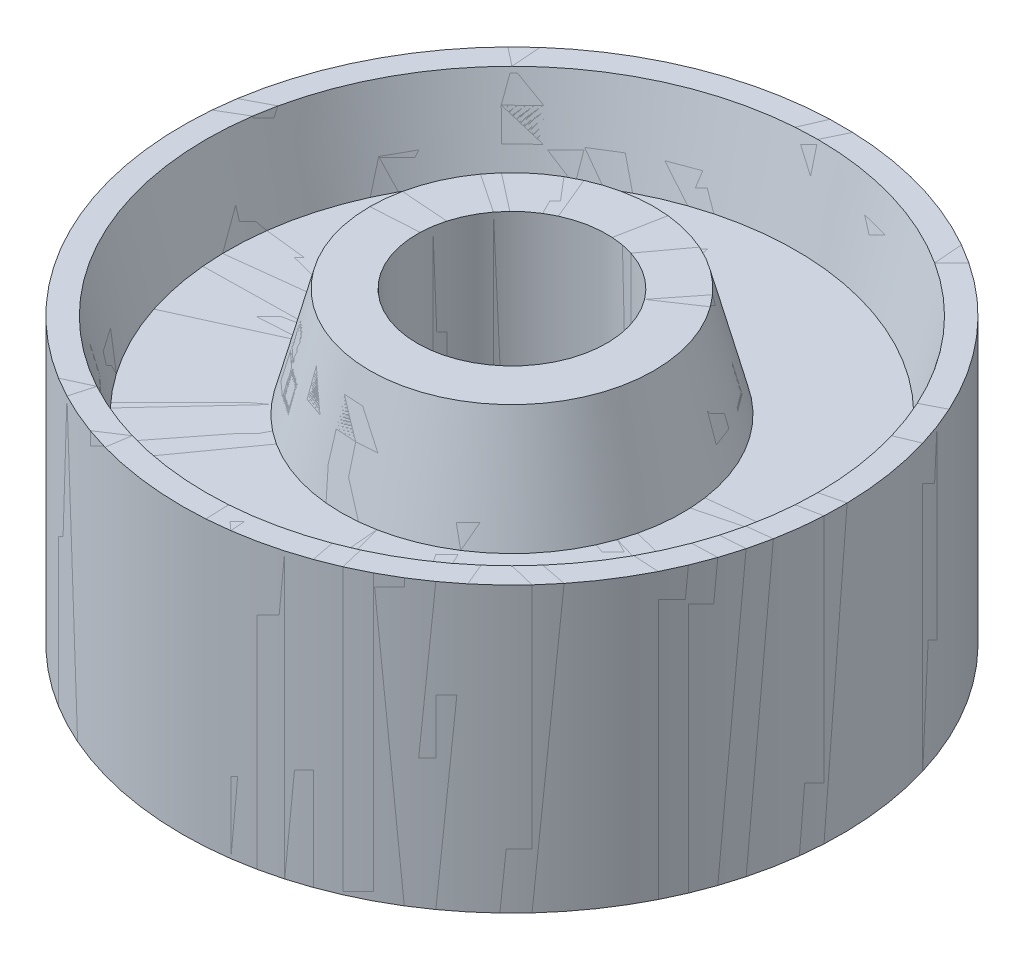
ISO-10303-21;
HEADER;
FILE_DESCRIPTION(('STEP AP214'),'2;1');
FILE_NAME('part.step','',(''),(''),'','','');
FILE_SCHEMA(('AUTOMOTIVE_DESIGN { 1 0 10303 214 1 1 1 1 }'));
ENDSEC;
DATA;
#1=APPLICATION_CONTEXT('core data for automotive mechanical design processes');
#2=APPLICATION_PROTOCOL_DEFINITION('international standard','automotive_design',2000,#1);
#3=PRODUCT_CONTEXT('',#1,'mechanical');
#4=PRODUCT('Part','Part','',(#3));
#5=PRODUCT_RELATED_PRODUCT_CATEGORY('part','',(#4));
#6=PRODUCT_DEFINITION_FORMATION('','',#4);
#7=PRODUCT_DEFINITION_CONTEXT('part definition',#1,'design');
#8=PRODUCT_DEFINITION('design','',#6,#7);
#9=PRODUCT_DEFINITION_SHAPE('','',#8);
#10=(LENGTH_UNIT() NAMED_UNIT(*) SI_UNIT(.MILLI.,.METRE.));
#11=(NAMED_UNIT(*) PLANE_ANGLE_UNIT() SI_UNIT($,.RADIAN.));
#12=(NAMED_UNIT(*) SI_UNIT($,.STERADIAN.) SOLID_ANGLE_UNIT());
#13=UNCERTAINTY_MEASURE_WITH_UNIT(LENGTH_MEASURE(1.E-05),#10,'distance_accuracy_value','');
#14=(GEOMETRIC_REPRESENTATION_CONTEXT(3) GLOBAL_UNCERTAINTY_ASSIGNED_CONTEXT((#13)) GLOBAL_UNIT_ASSIGNED_CONTEXT((#10,
#11,#12)) REPRESENTATION_CONTEXT('',''));
#15=CARTESIAN_POINT('',(0.,0.,0.));
#16=DIRECTION('',(0.,0.,1.));
#17=DIRECTION('',(1.,0.,0.));
#18=AXIS2_PLACEMENT_3D('',#15,#16,#17);
#19=CARTESIAN_POINT('',(41.021,17.7742163580739,0.));
#20=DIRECTION('',(0.,-1.,0.));
#21=DIRECTION('',(0.,0.,-1.));
#22=AXIS2_PLACEMENT_3D('',#19,#20,#21);
#23=PLANE('',#22);
#24=CARTESIAN_POINT('',(0.,17.7742163580739,0.));
#25=DIRECTION('',(0.,1.,0.));
#26=DIRECTION('',(0.,0.,1.));
#27=AXIS2_PLACEMENT_3D('',#24,#25,#26);
#28=CIRCLE('',#27,41.021);
#29=CARTESIAN_POINT('',(0.,17.7742163580739,41.021));
#30=VERTEX_POINT('',#29);
#31=EDGE_CURVE('E80',#30,#30,#28,.T.);
#32=ORIENTED_EDGE('',*,*,#31,.F.);
#33=EDGE_LOOP('',(#32));
#34=FACE_BOUND('',#33,.T.);
#35=CARTESIAN_POINT('',(0.,17.7742163580739,0.));
#36=DIRECTION('',(0.,1.,0.));
#37=DIRECTION('',(0.,0.,1.));
#38=AXIS2_PLACEMENT_3D('',#35,#36,#37);
#39=CIRCLE('',#38,44.196);
#40=CARTESIAN_POINT('',(0.,17.7742163580739,44.196));
#41=VERTEX_POINT('',#40);
#42=EDGE_CURVE('E11',#41,#41,#39,.T.);
#43=ORIENTED_EDGE('',*,*,#42,.T.);
#44=EDGE_LOOP('',(#43));
#45=FACE_BOUND('',#44,.T.);
#46=ADVANCED_FACE('F40',(#34,#45),#23,.F.);
#47=CARTESIAN_POINT('',(0.,42.7314059871606,0.));
#48=DIRECTION('',(0.,1.,0.));
#49=DIRECTION('',(0.,0.,1.));
#50=AXIS2_PLACEMENT_3D('',#47,#48,#49);
#51=CYLINDRICAL_SURFACE('',#50,44.196);
#52=ORIENTED_EDGE('',*,*,#42,.F.);
#53=EDGE_LOOP('',(#52));
#54=FACE_BOUND('',#53,.T.);
#55=CARTESIAN_POINT('',(0.,-20.3257836419261,0.));
#56=DIRECTION('',(0.,1.,0.));
#57=DIRECTION('',(0.,0.,1.));
#58=AXIS2_PLACEMENT_3D('',#55,#56,#57);
#59=CIRCLE('',#58,44.196);
#60=CARTESIAN_POINT('',(0.,-20.3257836419261,44.196));
#61=VERTEX_POINT('',#60);
#62=EDGE_CURVE('E46',#61,#61,#59,.T.);
#63=ORIENTED_EDGE('',*,*,#62,.T.);
#64=EDGE_LOOP('',(#63));
#65=FACE_BOUND('',#64,.T.);
#66=ADVANCED_FACE('F87',(#54,#65),#51,.T.);
#67=CARTESIAN_POINT('',(44.196,-20.3257836419261,0.));
#68=DIRECTION('',(0.,1.,0.));
#69=DIRECTION('',(0.,0.,1.));
#70=AXIS2_PLACEMENT_3D('',#67,#68,#69);
#71=PLANE('',#70);
#72=ORIENTED_EDGE('',*,*,#62,.F.);
#73=EDGE_LOOP('',(#72));
#74=FACE_BOUND('',#73,.T.);
#75=CARTESIAN_POINT('',(0.,-20.3257836419261,0.));
#76=DIRECTION('',(0.,1.,0.));
#77=DIRECTION('',(0.,0.,1.));
#78=AXIS2_PLACEMENT_3D('',#75,#76,#77);
#79=CIRCLE('',#78,41.021);
#80=CARTESIAN_POINT('',(0.,-20.3257836419261,41.021));
#81=VERTEX_POINT('',#80);
#82=EDGE_CURVE('E50',#81,#81,#79,.T.);
#83=ORIENTED_EDGE('',*,*,#82,.T.);
#84=EDGE_LOOP('',(#83));
#85=FACE_BOUND('',#84,.T.);
#86=ADVANCED_FACE('F91',(#74,#85),#71,.F.);
#87=CARTESIAN_POINT('',(0.,-8.89578364192612,0.));
#88=DIRECTION('',(0.,-1.,0.));
#89=DIRECTION('',(0.,0.,-1.));
#90=AXIS2_PLACEMENT_3D('',#87,#88,#89);
#91=CONICAL_SURFACE('',#90,38.1,0.25020054777764);
#92=ORIENTED_EDGE('',*,*,#82,.F.);
#93=EDGE_LOOP('',(#92));
#94=FACE_BOUND('',#93,.T.);
#95=CARTESIAN_POINT('',(0.,-8.89578364192612,0.));
#96=DIRECTION('',(0.,1.,0.));
#97=DIRECTION('',(0.,0.,1.));
#98=AXIS2_PLACEMENT_3D('',#95,#96,#97);
#99=CIRCLE('',#98,38.1);
#100=CARTESIAN_POINT('',(0.,-8.89578364192612,38.1));
#101=VERTEX_POINT('',#100);
#102=EDGE_CURVE('E54',#101,#101,#99,.T.);
#103=ORIENTED_EDGE('',*,*,#102,.T.);
#104=EDGE_LOOP('',(#103));
#105=FACE_BOUND('',#104,.T.);
#106=ADVANCED_FACE('F96',(#94,#105),#91,.F.);
#107=CARTESIAN_POINT('',(38.1,-8.89578364192612,0.));
#108=DIRECTION('',(0.,1.,0.));
#109=DIRECTION('',(0.,0.,1.));
#110=AXIS2_PLACEMENT_3D('',#107,#108,#109);
#111=PLANE('',#110);
#112=ORIENTED_EDGE('',*,*,#102,.F.);
#113=EDGE_LOOP('',(#112));
#114=FACE_BOUND('',#113,.T.);
#115=CARTESIAN_POINT('',(0.,-8.89578364192611,0.));
#116=DIRECTION('',(0.,1.,0.));
#117=DIRECTION('',(0.,0.,1.));
#118=AXIS2_PLACEMENT_3D('',#115,#116,#117);
#119=CIRCLE('',#118,22.86);
#120=CARTESIAN_POINT('',(0.,-8.89578364192611,22.86));
#121=VERTEX_POINT('',#120);
#122=EDGE_CURVE('E59',#121,#121,#119,.T.);
#123=ORIENTED_EDGE('',*,*,#122,.T.);
#124=EDGE_LOOP('',(#123));
#125=FACE_BOUND('',#124,.T.);
#126=ADVANCED_FACE('F102',(#114,#125),#111,.F.);
#127=CARTESIAN_POINT('',(0.,-23.5007836419261,0.));
#128=DIRECTION('',(0.,1.,0.));
#129=DIRECTION('',(0.,0.,1.));
#130=AXIS2_PLACEMENT_3D('',#127,#128,#129);
#131=CONICAL_SURFACE('',#130,19.05,0.255182390620818);
#132=ORIENTED_EDGE('',*,*,#122,.F.);
#133=EDGE_LOOP('',(#132));
#134=FACE_BOUND('',#133,.T.);
#135=CARTESIAN_POINT('',(0.,-23.5007836419261,0.));
#136=DIRECTION('',(0.,1.,0.));
#137=DIRECTION('',(0.,0.,1.));
#138=AXIS2_PLACEMENT_3D('',#135,#136,#137);
#139=CIRCLE('',#138,19.05);
#140=CARTESIAN_POINT('',(0.,-23.5007836419261,19.05));
#141=VERTEX_POINT('',#140);
#142=EDGE_CURVE('E62',#141,#141,#139,.T.);
#143=ORIENTED_EDGE('',*,*,#142,.T.);
#144=EDGE_LOOP('',(#143));
#145=FACE_BOUND('',#144,.T.);
#146=ADVANCED_FACE('F106',(#134,#145),#131,.T.);
#147=CARTESIAN_POINT('',(19.05,-23.5007836419261,0.));
#148=DIRECTION('',(0.,1.,0.));
#149=DIRECTION('',(0.,0.,1.));
#150=AXIS2_PLACEMENT_3D('',#147,#148,#149);
#151=PLANE('',#150);
#152=ORIENTED_EDGE('',*,*,#142,.F.);
#153=EDGE_LOOP('',(#152));
#154=FACE_BOUND('',#153,.T.);
#155=CARTESIAN_POINT('',(0.,-23.5007836419261,0.));
#156=DIRECTION('',(0.,1.,0.));
#157=DIRECTION('',(0.,0.,1.));
#158=AXIS2_PLACEMENT_3D('',#155,#156,#157);
#159=CIRCLE('',#158,12.7);
#160=CARTESIAN_POINT('',(0.,-23.5007836419261,12.7));
#161=VERTEX_POINT('',#160);
#162=EDGE_CURVE('E65',#161,#161,#159,.T.);
#163=ORIENTED_EDGE('',*,*,#162,.T.);
#164=EDGE_LOOP('',(#163));
#165=FACE_BOUND('',#164,.T.);
#166=ADVANCED_FACE('F110',(#154,#165),#151,.F.);
#167=CARTESIAN_POINT('',(0.,42.7314059871606,0.));
#168=DIRECTION('',(0.,1.,0.));
#169=DIRECTION('',(0.,0.,1.));
#170=AXIS2_PLACEMENT_3D('',#167,#168,#169);
#171=CYLINDRICAL_SURFACE('',#170,12.7);
#172=ORIENTED_EDGE('',*,*,#162,.F.);
#173=EDGE_LOOP('',(#172));
#174=FACE_BOUND('',#173,.T.);
#175=CARTESIAN_POINT('',(0.,20.9492163580739,0.));
#176=DIRECTION('',(0.,1.,0.));
#177=DIRECTION('',(0.,0.,1.));
#178=AXIS2_PLACEMENT_3D('',#175,#176,#177);
#179=CIRCLE('',#178,12.7);
#180=CARTESIAN_POINT('',(0.,20.9492163580739,12.7));
#181=VERTEX_POINT('',#180);
#182=EDGE_CURVE('E68',#181,#181,#179,.T.);
#183=ORIENTED_EDGE('',*,*,#182,.T.);
#184=EDGE_LOOP('',(#183));
#185=FACE_BOUND('',#184,.T.);
#186=ADVANCED_FACE('F114',(#174,#185),#171,.F.);
#187=CARTESIAN_POINT('',(12.7,20.9492163580739,0.));
#188=DIRECTION('',(0.,-1.,0.));
#189=DIRECTION('',(0.,0.,-1.));
#190=AXIS2_PLACEMENT_3D('',#187,#188,#189);
#191=PLANE('',#190);
#192=ORIENTED_EDGE('',*,*,#182,.F.);
#193=EDGE_LOOP('',(#192));
#194=FACE_BOUND('',#193,.T.);
#195=CARTESIAN_POINT('',(0.,20.9492163580739,0.));
#196=DIRECTION('',(0.,1.,0.));
#197=DIRECTION('',(0.,0.,1.));
#198=AXIS2_PLACEMENT_3D('',#195,#196,#197);
#199=CIRCLE('',#198,19.05);
#200=CARTESIAN_POINT('',(0.,20.9492163580739,19.05));
#201=VERTEX_POINT('',#200);
#202=EDGE_CURVE('E71',#201,#201,#199,.T.);
#203=ORIENTED_EDGE('',*,*,#202,.T.);
#204=EDGE_LOOP('',(#203));
#205=FACE_BOUND('',#204,.T.);
#206=ADVANCED_FACE('F118',(#194,#205),#191,.F.);
#207=CARTESIAN_POINT('',(0.,6.34421635807388,0.));
#208=DIRECTION('',(0.,-1.,0.));
#209=DIRECTION('',(0.,0.,-1.));
#210=AXIS2_PLACEMENT_3D('',#207,#208,#209);
#211=CONICAL_SURFACE('',#210,22.86,0.255182390620818);
#212=ORIENTED_EDGE('',*,*,#202,.F.);
#213=EDGE_LOOP('',(#212));
#214=FACE_BOUND('',#213,.T.);
#215=CARTESIAN_POINT('',(0.,6.34421635807388,0.));
#216=DIRECTION('',(0.,1.,0.));
#217=DIRECTION('',(0.,0.,1.));
#218=AXIS2_PLACEMENT_3D('',#215,#216,#217);
#219=CIRCLE('',#218,22.86);
#220=CARTESIAN_POINT('',(0.,6.34421635807388,22.86));
#221=VERTEX_POINT('',#220);
#222=EDGE_CURVE('E74',#221,#221,#219,.T.);
#223=ORIENTED_EDGE('',*,*,#222,.T.);
#224=EDGE_LOOP('',(#223));
#225=FACE_BOUND('',#224,.T.);
#226=ADVANCED_FACE('F122',(#214,#225),#211,.T.);
#227=CARTESIAN_POINT('',(22.86,6.34421635807388,0.));
#228=DIRECTION('',(0.,-1.,0.));
#229=DIRECTION('',(0.,0.,-1.));
#230=AXIS2_PLACEMENT_3D('',#227,#228,#229);
#231=PLANE('',#230);
#232=ORIENTED_EDGE('',*,*,#222,.F.);
#233=EDGE_LOOP('',(#232));
#234=FACE_BOUND('',#233,.T.);
#235=CARTESIAN_POINT('',(0.,6.34421635807388,0.));
#236=DIRECTION('',(0.,1.,0.));
#237=DIRECTION('',(0.,0.,1.));
#238=AXIS2_PLACEMENT_3D('',#235,#236,#237);
#239=CIRCLE('',#238,38.1);
#240=CARTESIAN_POINT('',(0.,6.34421635807388,38.1));
#241=VERTEX_POINT('',#240);
#242=EDGE_CURVE('E77',#241,#241,#239,.T.);
#243=ORIENTED_EDGE('',*,*,#242,.T.);
#244=EDGE_LOOP('',(#243));
#245=FACE_BOUND('',#244,.T.);
#246=ADVANCED_FACE('F126',(#234,#245),#231,.F.);
#247=CARTESIAN_POINT('',(0.,17.7742163580739,0.));
#248=DIRECTION('',(0.,1.,0.));
#249=DIRECTION('',(0.,0.,1.));
#250=AXIS2_PLACEMENT_3D('',#247,#248,#249);
#251=CONICAL_SURFACE('',#250,41.021,0.25020054777764);
#252=ORIENTED_EDGE('',*,*,#242,.F.);
#253=EDGE_LOOP('',(#252));
#254=FACE_BOUND('',#253,.T.);
#255=ORIENTED_EDGE('',*,*,#31,.T.);
#256=EDGE_LOOP('',(#255));
#257=FACE_BOUND('',#256,.T.);
#258=ADVANCED_FACE('F84',(#254,#257),#251,.F.);
#259=CLOSED_SHELL('',(#46,#66,#86,#106,#126,#146,#166,#186,#206,#226,#246,#258));
#260=MANIFOLD_SOLID_BREP('B2',#259);
#261=CARTESIAN_POINT('',(0.,42.7314059871606,0.));
#262=DIRECTION('',(0.,1.,0.));
#263=DIRECTION('',(0.,0.,1.));
#264=AXIS2_PLACEMENT_3D('',#261,#262,#263);
#265=CYLINDRICAL_SURFACE('',#264,44.196);
#266=CARTESIAN_POINT('',(0.,-20.3257836419261,0.));
#267=DIRECTION('',(0.,1.,0.));
#268=DIRECTION('',(0.,0.,1.));
#269=AXIS2_PLACEMENT_3D('',#266,#267,#268);
#270=CIRCLE('',#269,44.196);
#271=CARTESIAN_POINT('',(0.,-20.3257836419261,44.196));
#272=VERTEX_POINT('',#271);
#273=EDGE_CURVE('E39',#272,#272,#270,.T.);
#274=ORIENTED_EDGE('',*,*,#273,.T.);
#275=EDGE_LOOP('',(#274));
#276=FACE_BOUND('',#275,.T.);
#277=CARTESIAN_POINT('',(0.,17.7742163580739,0.));
#278=DIRECTION('',(0.,1.,0.));
#279=DIRECTION('',(0.,0.,1.));
#280=AXIS2_PLACEMENT_3D('',#277,#278,#279);
#281=CIRCLE('',#280,44.196);
#282=CARTESIAN_POINT('',(0.,17.7742163580739,44.196));
#283=VERTEX_POINT('',#282);
#284=EDGE_CURVE('E261',#283,#283,#281,.T.);
#285=ORIENTED_EDGE('',*,*,#284,.F.);
#286=EDGE_LOOP('',(#285));
#287=FACE_BOUND('',#286,.T.);
#288=ADVANCED_FACE('F221',(#276,#287),#265,.T.);
#289=CARTESIAN_POINT('',(-44.196,-20.3257836419261,0.));
#290=DIRECTION('',(0.,-1.,0.));
#291=DIRECTION('',(0.,0.,-1.));
#292=AXIS2_PLACEMENT_3D('',#289,#290,#291);
#293=PLANE('',#292);
#294=CARTESIAN_POINT('',(0.,-20.3257836419261,0.));
#295=DIRECTION('',(0.,1.,0.));
#296=DIRECTION('',(0.,0.,1.));
#297=AXIS2_PLACEMENT_3D('',#294,#295,#296);
#298=CIRCLE('',#297,41.021);
#299=CARTESIAN_POINT('',(0.,-20.3257836419261,41.021));
#300=VERTEX_POINT('',#299);
#301=EDGE_CURVE('E227',#300,#300,#298,.T.);
#302=ORIENTED_EDGE('',*,*,#301,.T.);
#303=EDGE_LOOP('',(#302));
#304=FACE_BOUND('',#303,.T.);
#305=ORIENTED_EDGE('',*,*,#273,.F.);
#306=EDGE_LOOP('',(#305));
#307=FACE_BOUND('',#306,.T.);
#308=ADVANCED_FACE('F269',(#304,#307),#293,.T.);
#309=CARTESIAN_POINT('',(0.,-20.3257836419261,0.));
#310=DIRECTION('',(0.,-1.,0.));
#311=DIRECTION('',(0.,0.,-1.));
#312=AXIS2_PLACEMENT_3D('',#309,#310,#311);
#313=CONICAL_SURFACE('',#312,41.021,0.25020054777764);
#314=CARTESIAN_POINT('',(0.,-8.89578364192611,0.));
#315=DIRECTION('',(0.,1.,0.));
#316=DIRECTION('',(0.,0.,1.));
#317=AXIS2_PLACEMENT_3D('',#314,#315,#316);
#318=CIRCLE('',#317,38.1);
#319=CARTESIAN_POINT('',(0.,-8.89578364192611,38.1));
#320=VERTEX_POINT('',#319);
#321=EDGE_CURVE('E231',#320,#320,#318,.T.);
#322=ORIENTED_EDGE('',*,*,#321,.T.);
#323=EDGE_LOOP('',(#322));
#324=FACE_BOUND('',#323,.T.);
#325=ORIENTED_EDGE('',*,*,#301,.F.);
#326=EDGE_LOOP('',(#325));
#327=FACE_BOUND('',#326,.T.);
#328=ADVANCED_FACE('F273',(#324,#327),#313,.F.);
#329=CARTESIAN_POINT('',(-38.1,-8.89578364192611,0.));
#330=DIRECTION('',(0.,-1.,0.));
#331=DIRECTION('',(0.,0.,-1.));
#332=AXIS2_PLACEMENT_3D('',#329,#330,#331);
#333=PLANE('',#332);
#334=CARTESIAN_POINT('',(0.,-8.89578364192611,0.));
#335=DIRECTION('',(0.,1.,0.));
#336=DIRECTION('',(0.,0.,1.));
#337=AXIS2_PLACEMENT_3D('',#334,#335,#336);
#338=CIRCLE('',#337,22.86);
#339=CARTESIAN_POINT('',(0.,-8.89578364192611,22.86));
#340=VERTEX_POINT('',#339);
#341=EDGE_CURVE('E235',#340,#340,#338,.T.);
#342=ORIENTED_EDGE('',*,*,#341,.T.);
#343=EDGE_LOOP('',(#342));
#344=FACE_BOUND('',#343,.T.);
#345=ORIENTED_EDGE('',*,*,#321,.F.);
#346=EDGE_LOOP('',(#345));
#347=FACE_BOUND('',#346,.T.);
#348=ADVANCED_FACE('F277',(#344,#347),#333,.T.);
#349=CARTESIAN_POINT('',(0.,-8.89578364192611,0.));
#350=DIRECTION('',(0.,1.,0.));
#351=DIRECTION('',(0.,0.,1.));
#352=AXIS2_PLACEMENT_3D('',#349,#350,#351);
#353=CONICAL_SURFACE('',#352,22.86,0.255182390620818);
#354=CARTESIAN_POINT('',(0.,-23.5007836419261,0.));
#355=DIRECTION('',(0.,1.,0.));
#356=DIRECTION('',(0.,0.,1.));
#357=AXIS2_PLACEMENT_3D('',#354,#355,#356);
#358=CIRCLE('',#357,19.05);
#359=CARTESIAN_POINT('',(0.,-23.5007836419261,19.05));
#360=VERTEX_POINT('',#359);
#361=EDGE_CURVE('E240',#360,#360,#358,.T.);
#362=ORIENTED_EDGE('',*,*,#361,.T.);
#363=EDGE_LOOP('',(#362));
#364=FACE_BOUND('',#363,.T.);
#365=ORIENTED_EDGE('',*,*,#341,.F.);
#366=EDGE_LOOP('',(#365));
#367=FACE_BOUND('',#366,.T.);
#368=ADVANCED_FACE('F284',(#364,#367),#353,.T.);
#369=CARTESIAN_POINT('',(-19.05,-23.5007836419261,0.));
#370=DIRECTION('',(0.,-1.,0.));
#371=DIRECTION('',(0.,0.,-1.));
#372=AXIS2_PLACEMENT_3D('',#369,#370,#371);
#373=PLANE('',#372);
#374=CARTESIAN_POINT('',(0.,-23.5007836419261,0.));
#375=DIRECTION('',(0.,1.,0.));
#376=DIRECTION('',(0.,0.,1.));
#377=AXIS2_PLACEMENT_3D('',#374,#375,#376);
#378=CIRCLE('',#377,12.7);
#379=CARTESIAN_POINT('',(0.,-23.5007836419261,12.7));
#380=VERTEX_POINT('',#379);
#381=EDGE_CURVE('E243',#380,#380,#378,.T.);
#382=ORIENTED_EDGE('',*,*,#381,.T.);
#383=EDGE_LOOP('',(#382));
#384=FACE_BOUND('',#383,.T.);
#385=ORIENTED_EDGE('',*,*,#361,.F.);
#386=EDGE_LOOP('',(#385));
#387=FACE_BOUND('',#386,.T.);
#388=ADVANCED_FACE('F288',(#384,#387),#373,.T.);
#389=CARTESIAN_POINT('',(0.,42.7314059871606,0.));
#390=DIRECTION('',(0.,1.,0.));
#391=DIRECTION('',(0.,0.,1.));
#392=AXIS2_PLACEMENT_3D('',#389,#390,#391);
#393=CYLINDRICAL_SURFACE('',#392,12.7);
#394=CARTESIAN_POINT('',(0.,20.9492163580739,0.));
#395=DIRECTION('',(0.,1.,0.));
#396=DIRECTION('',(0.,0.,1.));
#397=AXIS2_PLACEMENT_3D('',#394,#395,#396);
#398=CIRCLE('',#397,12.7);
#399=CARTESIAN_POINT('',(0.,20.9492163580739,12.7));
#400=VERTEX_POINT('',#399);
#401=EDGE_CURVE('E246',#400,#400,#398,.T.);
#402=ORIENTED_EDGE('',*,*,#401,.T.);
#403=EDGE_LOOP('',(#402));
#404=FACE_BOUND('',#403,.T.);
#405=ORIENTED_EDGE('',*,*,#381,.F.);
#406=EDGE_LOOP('',(#405));
#407=FACE_BOUND('',#406,.T.);
#408=ADVANCED_FACE('F292',(#404,#407),#393,.F.);
#409=CARTESIAN_POINT('',(-12.7,20.9492163580739,0.));
#410=DIRECTION('',(0.,1.,0.));
#411=DIRECTION('',(0.,0.,1.));
#412=AXIS2_PLACEMENT_3D('',#409,#410,#411);
#413=PLANE('',#412);
#414=CARTESIAN_POINT('',(0.,20.9492163580739,0.));
#415=DIRECTION('',(0.,1.,0.));
#416=DIRECTION('',(0.,0.,1.));
#417=AXIS2_PLACEMENT_3D('',#414,#415,#416);
#418=CIRCLE('',#417,19.05);
#419=CARTESIAN_POINT('',(0.,20.9492163580739,19.05));
#420=VERTEX_POINT('',#419);
#421=EDGE_CURVE('E249',#420,#420,#418,.T.);
#422=ORIENTED_EDGE('',*,*,#421,.T.);
#423=EDGE_LOOP('',(#422));
#424=FACE_BOUND('',#423,.T.);
#425=ORIENTED_EDGE('',*,*,#401,.F.);
#426=EDGE_LOOP('',(#425));
#427=FACE_BOUND('',#426,.T.);
#428=ADVANCED_FACE('F296',(#424,#427),#413,.T.);
#429=CARTESIAN_POINT('',(0.,20.9492163580739,0.));
#430=DIRECTION('',(0.,-1.,0.));
#431=DIRECTION('',(0.,0.,-1.));
#432=AXIS2_PLACEMENT_3D('',#429,#430,#431);
#433=CONICAL_SURFACE('',#432,19.05,0.255182390620818);
#434=CARTESIAN_POINT('',(0.,6.34421635807388,0.));
#435=DIRECTION('',(0.,1.,0.));
#436=DIRECTION('',(0.,0.,1.));
#437=AXIS2_PLACEMENT_3D('',#434,#435,#436);
#438=CIRCLE('',#437,22.86);
#439=CARTESIAN_POINT('',(0.,6.34421635807388,22.86));
#440=VERTEX_POINT('',#439);
#441=EDGE_CURVE('E252',#440,#440,#438,.T.);
#442=ORIENTED_EDGE('',*,*,#441,.T.);
#443=EDGE_LOOP('',(#442));
#444=FACE_BOUND('',#443,.T.);
#445=ORIENTED_EDGE('',*,*,#421,.F.);
#446=EDGE_LOOP('',(#445));
#447=FACE_BOUND('',#446,.T.);
#448=ADVANCED_FACE('F300',(#444,#447),#433,.T.);
#449=CARTESIAN_POINT('',(-22.86,6.34421635807388,0.));
#450=DIRECTION('',(0.,1.,0.));
#451=DIRECTION('',(0.,0.,1.));
#452=AXIS2_PLACEMENT_3D('',#449,#450,#451);
#453=PLANE('',#452);
#454=CARTESIAN_POINT('',(0.,6.34421635807388,0.));
#455=DIRECTION('',(0.,1.,0.));
#456=DIRECTION('',(0.,0.,1.));
#457=AXIS2_PLACEMENT_3D('',#454,#455,#456);
#458=CIRCLE('',#457,38.1);
#459=CARTESIAN_POINT('',(0.,6.34421635807388,38.1));
#460=VERTEX_POINT('',#459);
#461=EDGE_CURVE('E255',#460,#460,#458,.T.);
#462=ORIENTED_EDGE('',*,*,#461,.T.);
#463=EDGE_LOOP('',(#462));
#464=FACE_BOUND('',#463,.T.);
#465=ORIENTED_EDGE('',*,*,#441,.F.);
#466=EDGE_LOOP('',(#465));
#467=FACE_BOUND('',#466,.T.);
#468=ADVANCED_FACE('F304',(#464,#467),#453,.T.);
#469=CARTESIAN_POINT('',(0.,6.34421635807388,0.));
#470=DIRECTION('',(0.,1.,0.));
#471=DIRECTION('',(0.,0.,1.));
#472=AXIS2_PLACEMENT_3D('',#469,#470,#471);
#473=CONICAL_SURFACE('',#472,38.1,0.25020054777764);
#474=CARTESIAN_POINT('',(0.,17.7742163580739,0.));
#475=DIRECTION('',(0.,1.,0.));
#476=DIRECTION('',(0.,0.,1.));
#477=AXIS2_PLACEMENT_3D('',#474,#475,#476);
#478=CIRCLE('',#477,41.021);
#479=CARTESIAN_POINT('',(0.,17.7742163580739,41.021));
#480=VERTEX_POINT('',#479);
#481=EDGE_CURVE('E258',#480,#480,#478,.T.);
#482=ORIENTED_EDGE('',*,*,#481,.T.);
#483=EDGE_LOOP('',(#482));
#484=FACE_BOUND('',#483,.T.);
#485=ORIENTED_EDGE('',*,*,#461,.F.);
#486=EDGE_LOOP('',(#485));
#487=FACE_BOUND('',#486,.T.);
#488=ADVANCED_FACE('F308',(#484,#487),#473,.F.);
#489=CARTESIAN_POINT('',(-41.021,17.7742163580739,0.));
#490=DIRECTION('',(0.,1.,0.));
#491=DIRECTION('',(0.,0.,1.));
#492=AXIS2_PLACEMENT_3D('',#489,#490,#491);
#493=PLANE('',#492);
#494=ORIENTED_EDGE('',*,*,#284,.T.);
#495=EDGE_LOOP('',(#494));
#496=FACE_BOUND('',#495,.T.);
#497=ORIENTED_EDGE('',*,*,#481,.F.);
#498=EDGE_LOOP('',(#497));
#499=FACE_BOUND('',#498,.T.);
#500=ADVANCED_FACE('F265',(#496,#499),#493,.T.);
#501=CLOSED_SHELL('',(#288,#308,#328,#348,#368,#388,#408,#428,#448,#468,#488,#500));
#502=MANIFOLD_SOLID_BREP('B6',#501);
#503=ADVANCED_BREP_SHAPE_REPRESENTATION('',(#18,#260,#502),#14);
#504=SHAPE_DEFINITION_REPRESENTATION(#9,#503);
ENDSEC;
END-ISO-10303-21;
